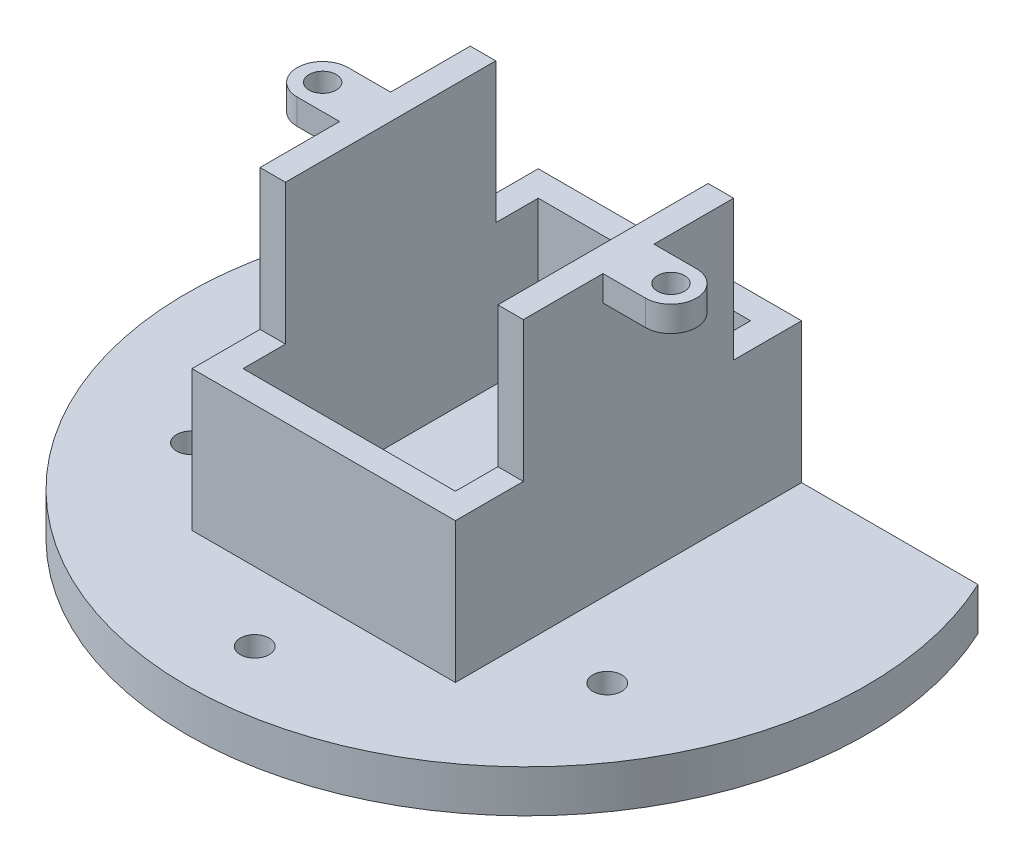
ISO-10303-21;
HEADER;
FILE_DESCRIPTION(('STEP AP214'),'2;1');
FILE_NAME('part.step','',(''),(''),'','','');
FILE_SCHEMA(('AUTOMOTIVE_DESIGN { 1 0 10303 214 1 1 1 1 }'));
ENDSEC;
DATA;
#1=APPLICATION_CONTEXT('core data for automotive mechanical design processes');
#2=APPLICATION_PROTOCOL_DEFINITION('international standard','automotive_design',2000,#1);
#3=PRODUCT_CONTEXT('',#1,'mechanical');
#4=PRODUCT('Part','Part','',(#3));
#5=PRODUCT_RELATED_PRODUCT_CATEGORY('part','',(#4));
#6=PRODUCT_DEFINITION_FORMATION('','',#4);
#7=PRODUCT_DEFINITION_CONTEXT('part definition',#1,'design');
#8=PRODUCT_DEFINITION('design','',#6,#7);
#9=PRODUCT_DEFINITION_SHAPE('','',#8);
#10=(LENGTH_UNIT() NAMED_UNIT(*) SI_UNIT(.MILLI.,.METRE.));
#11=(NAMED_UNIT(*) PLANE_ANGLE_UNIT() SI_UNIT($,.RADIAN.));
#12=(NAMED_UNIT(*) SI_UNIT($,.STERADIAN.) SOLID_ANGLE_UNIT());
#13=UNCERTAINTY_MEASURE_WITH_UNIT(LENGTH_MEASURE(1.E-05),#10,'distance_accuracy_value','');
#14=(GEOMETRIC_REPRESENTATION_CONTEXT(3) GLOBAL_UNCERTAINTY_ASSIGNED_CONTEXT((#13)) GLOBAL_UNIT_ASSIGNED_CONTEXT((#10,
#11,#12)) REPRESENTATION_CONTEXT('',''));
#15=CARTESIAN_POINT('',(0.,0.,0.));
#16=DIRECTION('',(0.,0.,1.));
#17=DIRECTION('',(1.,0.,0.));
#18=AXIS2_PLACEMENT_3D('',#15,#16,#17);
#19=CARTESIAN_POINT('',(0.,38.,-40.75));
#20=DIRECTION('',(0.,1.,0.));
#21=DIRECTION('',(0.,0.,1.));
#22=AXIS2_PLACEMENT_3D('',#19,#20,#21);
#23=PLANE('',#22);
#24=CARTESIAN_POINT('',(-5.,38.,-20.375));
#25=DIRECTION('',(0.,1.,0.));
#26=DIRECTION('',(0.,0.,-1.));
#27=AXIS2_PLACEMENT_3D('',#24,#25,#26);
#28=CIRCLE('',#27,1.6);
#29=CARTESIAN_POINT('',(-5.,38.,-21.975));
#30=VERTEX_POINT('',#29);
#31=EDGE_CURVE('E301',#30,#30,#28,.T.);
#32=ORIENTED_EDGE('',*,*,#31,.F.);
#33=EDGE_LOOP('',(#32));
#34=FACE_BOUND('',#33,.T.);
#35=DIRECTION('',(0.,0.,1.));
#36=VECTOR('',#35,1.);
#37=CARTESIAN_POINT('',(0.,38.,-40.75));
#38=LINE('',#37,#36);
#39=CARTESIAN_POINT('',(0.,38.,-17.375));
#40=VERTEX_POINT('',#39);
#41=CARTESIAN_POINT('',(0.,38.,-8.));
#42=VERTEX_POINT('',#41);
#43=EDGE_CURVE('E425',#40,#42,#38,.T.);
#44=ORIENTED_EDGE('',*,*,#43,.T.);
#45=DIRECTION('',(-1.,0.,0.));
#46=VECTOR('',#45,1.);
#47=CARTESIAN_POINT('',(0.,38.,-8.));
#48=LINE('',#47,#46);
#49=CARTESIAN_POINT('',(3.,38.,-8.));
#50=VERTEX_POINT('',#49);
#51=EDGE_CURVE('E228',#50,#42,#48,.T.);
#52=ORIENTED_EDGE('',*,*,#51,.F.);
#53=DIRECTION('',(0.,0.,1.));
#54=VECTOR('',#53,1.);
#55=CARTESIAN_POINT('',(3.,38.,-3.00000000000003));
#56=LINE('',#55,#54);
#57=CARTESIAN_POINT('',(2.99999999999999,38.,-32.75));
#58=VERTEX_POINT('',#57);
#59=EDGE_CURVE('E374',#58,#50,#56,.T.);
#60=ORIENTED_EDGE('',*,*,#59,.F.);
#61=DIRECTION('',(1.,0.,0.));
#62=VECTOR('',#61,1.);
#63=CARTESIAN_POINT('',(-9.75,38.,-32.75));
#64=LINE('',#63,#62);
#65=CARTESIAN_POINT('',(0.,38.,-32.75));
#66=VERTEX_POINT('',#65);
#67=EDGE_CURVE('E405',#66,#58,#64,.T.);
#68=ORIENTED_EDGE('',*,*,#67,.F.);
#69=CARTESIAN_POINT('',(0.,38.,-23.375));
#70=VERTEX_POINT('',#69);
#71=EDGE_CURVE('E421',#66,#70,#38,.T.);
#72=ORIENTED_EDGE('',*,*,#71,.T.);
#73=DIRECTION('',(-1.,0.,0.));
#74=VECTOR('',#73,1.);
#75=CARTESIAN_POINT('',(-5.,38.,-23.375));
#76=LINE('',#75,#74);
#77=CARTESIAN_POINT('',(-5.,38.,-23.375));
#78=VERTEX_POINT('',#77);
#79=EDGE_CURVE('E305',#70,#78,#76,.T.);
#80=ORIENTED_EDGE('',*,*,#79,.T.);
#81=CARTESIAN_POINT('',(-5.,38.,-20.375));
#82=DIRECTION('',(0.,1.,0.));
#83=DIRECTION('',(0.,0.,-1.));
#84=AXIS2_PLACEMENT_3D('',#81,#82,#83);
#85=CIRCLE('',#84,3.);
#86=CARTESIAN_POINT('',(-5.,38.,-17.375));
#87=VERTEX_POINT('',#86);
#88=EDGE_CURVE('E323',#78,#87,#85,.T.);
#89=ORIENTED_EDGE('',*,*,#88,.T.);
#90=DIRECTION('',(1.,0.,0.));
#91=VECTOR('',#90,1.);
#92=CARTESIAN_POINT('',(0.,38.,-17.375));
#93=LINE('',#92,#91);
#94=EDGE_CURVE('E312',#87,#40,#93,.T.);
#95=ORIENTED_EDGE('',*,*,#94,.T.);
#96=EDGE_LOOP('',(#44,#52,#60,#68,#72,#80,#89,#95));
#97=FACE_BOUND('',#96,.T.);
#98=ADVANCED_FACE('F38',(#34,#97),#23,.T.);
#99=CARTESIAN_POINT('',(36.,38.,-20.375));
#100=DIRECTION('',(0.,1.,0.));
#101=DIRECTION('',(0.,0.,1.));
#102=AXIS2_PLACEMENT_3D('',#99,#100,#101);
#103=CIRCLE('',#102,1.6);
#104=CARTESIAN_POINT('',(36.,38.,-18.775));
#105=VERTEX_POINT('',#104);
#106=EDGE_CURVE('E331',#105,#105,#103,.T.);
#107=ORIENTED_EDGE('',*,*,#106,.F.);
#108=EDGE_LOOP('',(#107));
#109=FACE_BOUND('',#108,.T.);
#110=DIRECTION('',(0.,0.,-1.));
#111=VECTOR('',#110,1.);
#112=CARTESIAN_POINT('',(28.,38.,-3.00000000000003));
#113=LINE('',#112,#111);
#114=CARTESIAN_POINT('',(28.,38.,-8.));
#115=VERTEX_POINT('',#114);
#116=CARTESIAN_POINT('',(28.,38.,-32.75));
#117=VERTEX_POINT('',#116);
#118=EDGE_CURVE('E366',#115,#117,#113,.T.);
#119=ORIENTED_EDGE('',*,*,#118,.F.);
#120=CARTESIAN_POINT('',(31.,38.,-8.));
#121=VERTEX_POINT('',#120);
#122=EDGE_CURVE('E236',#121,#115,#48,.T.);
#123=ORIENTED_EDGE('',*,*,#122,.F.);
#124=DIRECTION('',(0.,0.,1.));
#125=VECTOR('',#124,1.);
#126=CARTESIAN_POINT('',(31.,38.,-40.75));
#127=LINE('',#126,#125);
#128=CARTESIAN_POINT('',(31.,38.,-17.375));
#129=VERTEX_POINT('',#128);
#130=EDGE_CURVE('E417',#129,#121,#127,.T.);
#131=ORIENTED_EDGE('',*,*,#130,.F.);
#132=DIRECTION('',(1.,0.,0.));
#133=VECTOR('',#132,1.);
#134=CARTESIAN_POINT('',(31.,38.,-17.375));
#135=LINE('',#134,#133);
#136=CARTESIAN_POINT('',(36.,38.,-17.375));
#137=VERTEX_POINT('',#136);
#138=EDGE_CURVE('E347',#129,#137,#135,.T.);
#139=ORIENTED_EDGE('',*,*,#138,.T.);
#140=CARTESIAN_POINT('',(36.,38.,-20.375));
#141=DIRECTION('',(0.,1.,0.));
#142=DIRECTION('',(0.,0.,1.));
#143=AXIS2_PLACEMENT_3D('',#140,#141,#142);
#144=CIRCLE('',#143,3.);
#145=CARTESIAN_POINT('',(36.,38.,-23.375));
#146=VERTEX_POINT('',#145);
#147=EDGE_CURVE('E340',#137,#146,#144,.T.);
#148=ORIENTED_EDGE('',*,*,#147,.T.);
#149=DIRECTION('',(-1.,0.,0.));
#150=VECTOR('',#149,1.);
#151=CARTESIAN_POINT('',(36.,38.,-23.375));
#152=LINE('',#151,#150);
#153=CARTESIAN_POINT('',(31.,38.,-23.375));
#154=VERTEX_POINT('',#153);
#155=EDGE_CURVE('E359',#146,#154,#152,.T.);
#156=ORIENTED_EDGE('',*,*,#155,.T.);
#157=CARTESIAN_POINT('',(31.,38.,-32.75));
#158=VERTEX_POINT('',#157);
#159=EDGE_CURVE('E426',#158,#154,#127,.T.);
#160=ORIENTED_EDGE('',*,*,#159,.F.);
#161=EDGE_CURVE('E399',#117,#158,#64,.T.);
#162=ORIENTED_EDGE('',*,*,#161,.F.);
#163=EDGE_LOOP('',(#119,#123,#131,#139,#148,#156,#160,#162));
#164=FACE_BOUND('',#163,.T.);
#165=ADVANCED_FACE('F505',(#109,#164),#23,.T.);
#166=CARTESIAN_POINT('',(0.,0.,-40.75));
#167=DIRECTION('',(-1.,0.,0.));
#168=DIRECTION('',(0.,0.,1.));
#169=AXIS2_PLACEMENT_3D('',#166,#167,#168);
#170=PLANE('',#169);
#171=DIRECTION('',(0.,0.,1.));
#172=VECTOR('',#171,1.);
#173=CARTESIAN_POINT('',(0.,21.5,-8.));
#174=LINE('',#173,#172);
#175=CARTESIAN_POINT('',(0.,21.5,-8.));
#176=VERTEX_POINT('',#175);
#177=CARTESIAN_POINT('',(0.,21.5,0.));
#178=VERTEX_POINT('',#177);
#179=EDGE_CURVE('E216',#176,#178,#174,.T.);
#180=ORIENTED_EDGE('',*,*,#179,.F.);
#181=DIRECTION('',(0.,-1.,0.));
#182=VECTOR('',#181,1.);
#183=CARTESIAN_POINT('',(0.,38.,-8.));
#184=LINE('',#183,#182);
#185=EDGE_CURVE('E225',#42,#176,#184,.T.);
#186=ORIENTED_EDGE('',*,*,#185,.F.);
#187=ORIENTED_EDGE('',*,*,#43,.F.);
#188=DIRECTION('',(0.,1.,0.));
#189=VECTOR('',#188,1.);
#190=CARTESIAN_POINT('',(0.,35.,-17.375));
#191=LINE('',#190,#189);
#192=CARTESIAN_POINT('',(0.,35.,-17.375));
#193=VERTEX_POINT('',#192);
#194=EDGE_CURVE('E332',#193,#40,#191,.T.);
#195=ORIENTED_EDGE('',*,*,#194,.F.);
#196=DIRECTION('',(0.,0.,-1.));
#197=VECTOR('',#196,1.);
#198=CARTESIAN_POINT('',(0.,35.,-23.375));
#199=LINE('',#198,#197);
#200=CARTESIAN_POINT('',(0.,35.,-23.375));
#201=VERTEX_POINT('',#200);
#202=EDGE_CURVE('E317',#193,#201,#199,.T.);
#203=ORIENTED_EDGE('',*,*,#202,.T.);
#204=DIRECTION('',(0.,1.,0.));
#205=VECTOR('',#204,1.);
#206=CARTESIAN_POINT('',(0.,35.,-23.375));
#207=LINE('',#206,#205);
#208=EDGE_CURVE('E328',#201,#70,#207,.T.);
#209=ORIENTED_EDGE('',*,*,#208,.T.);
#210=ORIENTED_EDGE('',*,*,#71,.F.);
#211=DIRECTION('',(0.,1.,0.));
#212=VECTOR('',#211,1.);
#213=CARTESIAN_POINT('',(0.,0.,-32.75));
#214=LINE('',#213,#212);
#215=CARTESIAN_POINT('',(0.,21.5,-32.75));
#216=VERTEX_POINT('',#215);
#217=EDGE_CURVE('E409',#216,#66,#214,.T.);
#218=ORIENTED_EDGE('',*,*,#217,.F.);
#219=DIRECTION('',(0.,0.,1.));
#220=VECTOR('',#219,1.);
#221=CARTESIAN_POINT('',(0.,21.5,-40.75));
#222=LINE('',#221,#220);
#223=CARTESIAN_POINT('',(0.,21.5,-40.75));
#224=VERTEX_POINT('',#223);
#225=EDGE_CURVE('E403',#224,#216,#222,.T.);
#226=ORIENTED_EDGE('',*,*,#225,.F.);
#227=DIRECTION('',(0.,-1.,0.));
#228=VECTOR('',#227,1.);
#229=CARTESIAN_POINT('',(0.,0.,-40.75));
#230=LINE('',#229,#228);
#231=CARTESIAN_POINT('',(0.,5.,-40.75));
#232=VERTEX_POINT('',#231);
#233=EDGE_CURVE('E61',#224,#232,#230,.T.);
#234=ORIENTED_EDGE('',*,*,#233,.T.);
#235=DIRECTION('',(0.,0.,1.));
#236=VECTOR('',#235,1.);
#237=CARTESIAN_POINT('',(0.,5.,-40.75));
#238=LINE('',#237,#236);
#239=CARTESIAN_POINT('',(0.,5.,0.));
#240=VERTEX_POINT('',#239);
#241=EDGE_CURVE('E299',#232,#240,#238,.T.);
#242=ORIENTED_EDGE('',*,*,#241,.T.);
#243=DIRECTION('',(0.,-1.,0.));
#244=VECTOR('',#243,1.);
#245=CARTESIAN_POINT('',(0.,0.,0.));
#246=LINE('',#245,#244);
#247=EDGE_CURVE('E234',#178,#240,#246,.T.);
#248=ORIENTED_EDGE('',*,*,#247,.F.);
#249=EDGE_LOOP('',(#180,#186,#187,#195,#203,#209,#210,#218,#226,#234,#242,#248));
#250=FACE_BOUND('',#249,.T.);
#251=ADVANCED_FACE('F40',(#250),#170,.T.);
#252=CARTESIAN_POINT('',(31.,0.,-40.75));
#253=DIRECTION('',(1.,0.,0.));
#254=DIRECTION('',(0.,0.,-1.));
#255=AXIS2_PLACEMENT_3D('',#252,#253,#254);
#256=PLANE('',#255);
#257=DIRECTION('',(0.,0.,1.));
#258=VECTOR('',#257,1.);
#259=CARTESIAN_POINT('',(31.,21.5,-8.));
#260=LINE('',#259,#258);
#261=CARTESIAN_POINT('',(31.,21.5,-8.));
#262=VERTEX_POINT('',#261);
#263=CARTESIAN_POINT('',(31.,21.5,0.));
#264=VERTEX_POINT('',#263);
#265=EDGE_CURVE('E235',#262,#264,#260,.T.);
#266=ORIENTED_EDGE('',*,*,#265,.T.);
#267=DIRECTION('',(0.,1.,0.));
#268=VECTOR('',#267,1.);
#269=CARTESIAN_POINT('',(31.,0.,0.));
#270=LINE('',#269,#268);
#271=CARTESIAN_POINT('',(31.,5.,0.));
#272=VERTEX_POINT('',#271);
#273=EDGE_CURVE('E413',#272,#264,#270,.T.);
#274=ORIENTED_EDGE('',*,*,#273,.F.);
#275=DIRECTION('',(0.,0.,-1.));
#276=VECTOR('',#275,1.);
#277=CARTESIAN_POINT('',(31.,5.,-40.75));
#278=LINE('',#277,#276);
#279=CARTESIAN_POINT('',(31.,5.,-40.75));
#280=VERTEX_POINT('',#279);
#281=EDGE_CURVE('E297',#272,#280,#278,.T.);
#282=ORIENTED_EDGE('',*,*,#281,.T.);
#283=DIRECTION('',(0.,1.,0.));
#284=VECTOR('',#283,1.);
#285=CARTESIAN_POINT('',(31.,0.,-40.75));
#286=LINE('',#285,#284);
#287=CARTESIAN_POINT('',(31.,21.5,-40.75));
#288=VERTEX_POINT('',#287);
#289=EDGE_CURVE('E415',#280,#288,#286,.T.);
#290=ORIENTED_EDGE('',*,*,#289,.T.);
#291=DIRECTION('',(0.,0.,-1.));
#292=VECTOR('',#291,1.);
#293=CARTESIAN_POINT('',(31.,21.5,-40.75));
#294=LINE('',#293,#292);
#295=CARTESIAN_POINT('',(31.,21.5,-32.75));
#296=VERTEX_POINT('',#295);
#297=EDGE_CURVE('E396',#296,#288,#294,.T.);
#298=ORIENTED_EDGE('',*,*,#297,.F.);
#299=DIRECTION('',(0.,-1.,0.));
#300=VECTOR('',#299,1.);
#301=CARTESIAN_POINT('',(31.,38.,-32.75));
#302=LINE('',#301,#300);
#303=EDGE_CURVE('E393',#158,#296,#302,.T.);
#304=ORIENTED_EDGE('',*,*,#303,.F.);
#305=ORIENTED_EDGE('',*,*,#159,.T.);
#306=DIRECTION('',(0.,1.,0.));
#307=VECTOR('',#306,1.);
#308=CARTESIAN_POINT('',(31.,35.,-23.375));
#309=LINE('',#308,#307);
#310=CARTESIAN_POINT('',(31.,35.,-23.375));
#311=VERTEX_POINT('',#310);
#312=EDGE_CURVE('E370',#311,#154,#309,.T.);
#313=ORIENTED_EDGE('',*,*,#312,.F.);
#314=DIRECTION('',(0.,0.,1.));
#315=VECTOR('',#314,1.);
#316=CARTESIAN_POINT('',(31.,35.,-23.375));
#317=LINE('',#316,#315);
#318=CARTESIAN_POINT('',(31.,35.,-17.375));
#319=VERTEX_POINT('',#318);
#320=EDGE_CURVE('E350',#311,#319,#317,.T.);
#321=ORIENTED_EDGE('',*,*,#320,.T.);
#322=DIRECTION('',(0.,1.,0.));
#323=VECTOR('',#322,1.);
#324=CARTESIAN_POINT('',(31.,35.,-17.375));
#325=LINE('',#324,#323);
#326=EDGE_CURVE('E367',#319,#129,#325,.T.);
#327=ORIENTED_EDGE('',*,*,#326,.T.);
#328=ORIENTED_EDGE('',*,*,#130,.T.);
#329=DIRECTION('',(0.,1.,0.));
#330=VECTOR('',#329,1.);
#331=CARTESIAN_POINT('',(31.,38.,-8.));
#332=LINE('',#331,#330);
#333=EDGE_CURVE('E53',#262,#121,#332,.T.);
#334=ORIENTED_EDGE('',*,*,#333,.F.);
#335=EDGE_LOOP('',(#266,#274,#282,#290,#298,#304,#305,#313,#321,#327,#328,#334));
#336=FACE_BOUND('',#335,.T.);
#337=ADVANCED_FACE('F457',(#336),#256,.T.);
#338=CARTESIAN_POINT('',(0.,0.,0.));
#339=DIRECTION('',(0.,0.,-1.));
#340=DIRECTION('',(-1.,0.,0.));
#341=AXIS2_PLACEMENT_3D('',#338,#339,#340);
#342=PLANE('',#341);
#343=ORIENTED_EDGE('',*,*,#273,.T.);
#344=DIRECTION('',(1.,0.,0.));
#345=VECTOR('',#344,1.);
#346=CARTESIAN_POINT('',(0.,21.5,0.));
#347=LINE('',#346,#345);
#348=EDGE_CURVE('E231',#178,#264,#347,.T.);
#349=ORIENTED_EDGE('',*,*,#348,.F.);
#350=ORIENTED_EDGE('',*,*,#247,.T.);
#351=DIRECTION('',(-1.,0.,0.));
#352=VECTOR('',#351,1.);
#353=CARTESIAN_POINT('',(0.,5.,0.));
#354=LINE('',#353,#352);
#355=EDGE_CURVE('E294',#272,#240,#354,.T.);
#356=ORIENTED_EDGE('',*,*,#355,.F.);
#357=EDGE_LOOP('',(#343,#349,#350,#356));
#358=FACE_BOUND('',#357,.T.);
#359=ADVANCED_FACE('F460',(#358),#342,.F.);
#360=CARTESIAN_POINT('',(2.99999999999999,3.5,-37.75));
#361=DIRECTION('',(0.,0.,-1.));
#362=DIRECTION('',(-1.,0.,0.));
#363=AXIS2_PLACEMENT_3D('',#360,#361,#362);
#364=PLANE('',#363);
#365=DIRECTION('',(-1.,0.,0.));
#366=VECTOR('',#365,1.);
#367=CARTESIAN_POINT('',(2.99999999999999,5.,-37.75));
#368=LINE('',#367,#366);
#369=CARTESIAN_POINT('',(28.,5.,-37.75));
#370=VERTEX_POINT('',#369);
#371=CARTESIAN_POINT('',(2.99999999999999,5.,-37.75));
#372=VERTEX_POINT('',#371);
#373=EDGE_CURVE('E291',#370,#372,#368,.T.);
#374=ORIENTED_EDGE('',*,*,#373,.F.);
#375=DIRECTION('',(0.,1.,0.));
#376=VECTOR('',#375,1.);
#377=CARTESIAN_POINT('',(28.,3.5,-37.75));
#378=LINE('',#377,#376);
#379=CARTESIAN_POINT('',(28.,21.5,-37.75));
#380=VERTEX_POINT('',#379);
#381=EDGE_CURVE('E377',#370,#380,#378,.T.);
#382=ORIENTED_EDGE('',*,*,#381,.T.);
#383=DIRECTION('',(1.,0.,0.));
#384=VECTOR('',#383,1.);
#385=CARTESIAN_POINT('',(-9.75,21.5,-37.75));
#386=LINE('',#385,#384);
#387=CARTESIAN_POINT('',(2.99999999999999,21.5,-37.75));
#388=VERTEX_POINT('',#387);
#389=EDGE_CURVE('E436',#388,#380,#386,.T.);
#390=ORIENTED_EDGE('',*,*,#389,.F.);
#391=DIRECTION('',(0.,1.,0.));
#392=VECTOR('',#391,1.);
#393=CARTESIAN_POINT('',(2.99999999999999,3.5,-37.75));
#394=LINE('',#393,#392);
#395=EDGE_CURVE('E385',#372,#388,#394,.T.);
#396=ORIENTED_EDGE('',*,*,#395,.F.);
#397=EDGE_LOOP('',(#374,#382,#390,#396));
#398=FACE_BOUND('',#397,.T.);
#399=ADVANCED_FACE('F659',(#398),#364,.F.);
#400=CARTESIAN_POINT('',(28.,3.5,-3.00000000000003));
#401=DIRECTION('',(1.,0.,0.));
#402=DIRECTION('',(0.,0.,-1.));
#403=AXIS2_PLACEMENT_3D('',#400,#401,#402);
#404=PLANE('',#403);
#405=DIRECTION('',(0.,1.,0.));
#406=VECTOR('',#405,1.);
#407=CARTESIAN_POINT('',(28.,3.5,-3.00000000000003));
#408=LINE('',#407,#406);
#409=CARTESIAN_POINT('',(28.,5.,-3.00000000000003));
#410=VERTEX_POINT('',#409);
#411=CARTESIAN_POINT('',(28.,21.5,-3.00000000000003));
#412=VERTEX_POINT('',#411);
#413=EDGE_CURVE('E378',#410,#412,#408,.T.);
#414=ORIENTED_EDGE('',*,*,#413,.T.);
#415=DIRECTION('',(0.,0.,-1.));
#416=VECTOR('',#415,1.);
#417=CARTESIAN_POINT('',(28.,21.5,-3.00000000000003));
#418=LINE('',#417,#416);
#419=CARTESIAN_POINT('',(28.,21.5,-8.));
#420=VERTEX_POINT('',#419);
#421=EDGE_CURVE('E248',#412,#420,#418,.T.);
#422=ORIENTED_EDGE('',*,*,#421,.T.);
#423=DIRECTION('',(0.,-1.,0.));
#424=VECTOR('',#423,1.);
#425=CARTESIAN_POINT('',(28.,3.5,-8.));
#426=LINE('',#425,#424);
#427=EDGE_CURVE('E245',#115,#420,#426,.T.);
#428=ORIENTED_EDGE('',*,*,#427,.F.);
#429=ORIENTED_EDGE('',*,*,#118,.T.);
#430=DIRECTION('',(0.,1.,0.));
#431=VECTOR('',#430,1.);
#432=CARTESIAN_POINT('',(28.,38.,-32.75));
#433=LINE('',#432,#431);
#434=CARTESIAN_POINT('',(28.,21.5,-32.75));
#435=VERTEX_POINT('',#434);
#436=EDGE_CURVE('E433',#435,#117,#433,.T.);
#437=ORIENTED_EDGE('',*,*,#436,.F.);
#438=DIRECTION('',(0.,0.,1.));
#439=VECTOR('',#438,1.);
#440=CARTESIAN_POINT('',(28.,21.5,-40.75));
#441=LINE('',#440,#439);
#442=EDGE_CURVE('E390',#380,#435,#441,.T.);
#443=ORIENTED_EDGE('',*,*,#442,.F.);
#444=ORIENTED_EDGE('',*,*,#381,.F.);
#445=DIRECTION('',(0.,0.,-1.));
#446=VECTOR('',#445,1.);
#447=CARTESIAN_POINT('',(28.,5.,-3.00000000000003));
#448=LINE('',#447,#446);
#449=EDGE_CURVE('E288',#410,#370,#448,.T.);
#450=ORIENTED_EDGE('',*,*,#449,.F.);
#451=EDGE_LOOP('',(#414,#422,#428,#429,#437,#443,#444,#450));
#452=FACE_BOUND('',#451,.T.);
#453=ADVANCED_FACE('F663',(#452),#404,.F.);
#454=CARTESIAN_POINT('',(3.,3.5,-3.00000000000003));
#455=DIRECTION('',(-1.,0.,0.));
#456=DIRECTION('',(0.,0.,1.));
#457=AXIS2_PLACEMENT_3D('',#454,#455,#456);
#458=PLANE('',#457);
#459=DIRECTION('',(0.,1.,0.));
#460=VECTOR('',#459,1.);
#461=CARTESIAN_POINT('',(3.,3.5,-8.));
#462=LINE('',#461,#460);
#463=CARTESIAN_POINT('',(3.,21.5,-8.));
#464=VERTEX_POINT('',#463);
#465=EDGE_CURVE('E239',#464,#50,#462,.T.);
#466=ORIENTED_EDGE('',*,*,#465,.F.);
#467=DIRECTION('',(0.,0.,1.));
#468=VECTOR('',#467,1.);
#469=CARTESIAN_POINT('',(3.,21.5,-3.00000000000003));
#470=LINE('',#469,#468);
#471=CARTESIAN_POINT('',(3.,21.5,-3.00000000000003));
#472=VERTEX_POINT('',#471);
#473=EDGE_CURVE('E219',#464,#472,#470,.T.);
#474=ORIENTED_EDGE('',*,*,#473,.T.);
#475=DIRECTION('',(0.,1.,0.));
#476=VECTOR('',#475,1.);
#477=CARTESIAN_POINT('',(3.,3.5,-3.00000000000003));
#478=LINE('',#477,#476);
#479=CARTESIAN_POINT('',(3.,5.,-3.00000000000003));
#480=VERTEX_POINT('',#479);
#481=EDGE_CURVE('E382',#480,#472,#478,.T.);
#482=ORIENTED_EDGE('',*,*,#481,.F.);
#483=DIRECTION('',(0.,0.,1.));
#484=VECTOR('',#483,1.);
#485=CARTESIAN_POINT('',(3.,5.,-3.00000000000003));
#486=LINE('',#485,#484);
#487=EDGE_CURVE('E283',#372,#480,#486,.T.);
#488=ORIENTED_EDGE('',*,*,#487,.F.);
#489=ORIENTED_EDGE('',*,*,#395,.T.);
#490=DIRECTION('',(0.,0.,-1.));
#491=VECTOR('',#490,1.);
#492=CARTESIAN_POINT('',(2.99999999999999,21.5,-40.75));
#493=LINE('',#492,#491);
#494=CARTESIAN_POINT('',(2.99999999999999,21.5,-32.75));
#495=VERTEX_POINT('',#494);
#496=EDGE_CURVE('E381',#495,#388,#493,.T.);
#497=ORIENTED_EDGE('',*,*,#496,.F.);
#498=DIRECTION('',(0.,-1.,0.));
#499=VECTOR('',#498,1.);
#500=CARTESIAN_POINT('',(2.99999999999999,38.,-32.75));
#501=LINE('',#500,#499);
#502=EDGE_CURVE('E430',#58,#495,#501,.T.);
#503=ORIENTED_EDGE('',*,*,#502,.F.);
#504=ORIENTED_EDGE('',*,*,#59,.T.);
#505=EDGE_LOOP('',(#466,#474,#482,#488,#489,#497,#503,#504));
#506=FACE_BOUND('',#505,.T.);
#507=ADVANCED_FACE('F446',(#506),#458,.F.);
#508=CARTESIAN_POINT('',(3.,3.5,-3.00000000000003));
#509=DIRECTION('',(0.,0.,1.));
#510=DIRECTION('',(1.,0.,0.));
#511=AXIS2_PLACEMENT_3D('',#508,#509,#510);
#512=PLANE('',#511);
#513=ORIENTED_EDGE('',*,*,#481,.T.);
#514=DIRECTION('',(1.,0.,0.));
#515=VECTOR('',#514,1.);
#516=CARTESIAN_POINT('',(3.,21.5,-3.00000000000003));
#517=LINE('',#516,#515);
#518=EDGE_CURVE('E11',#472,#412,#517,.T.);
#519=ORIENTED_EDGE('',*,*,#518,.T.);
#520=ORIENTED_EDGE('',*,*,#413,.F.);
#521=DIRECTION('',(1.,0.,0.));
#522=VECTOR('',#521,1.);
#523=CARTESIAN_POINT('',(3.,5.,-3.00000000000003));
#524=LINE('',#523,#522);
#525=EDGE_CURVE('E46',#480,#410,#524,.T.);
#526=ORIENTED_EDGE('',*,*,#525,.F.);
#527=EDGE_LOOP('',(#513,#519,#520,#526));
#528=FACE_BOUND('',#527,.T.);
#529=ADVANCED_FACE('F444',(#528),#512,.F.);
#530=CARTESIAN_POINT('',(-9.75,38.,-32.75));
#531=DIRECTION('',(0.,0.,1.));
#532=DIRECTION('',(0.,-1.,0.));
#533=AXIS2_PLACEMENT_3D('',#530,#531,#532);
#534=PLANE('',#533);
#535=DIRECTION('',(1.,0.,0.));
#536=VECTOR('',#535,1.);
#537=CARTESIAN_POINT('',(-9.75,21.5,-32.75));
#538=LINE('',#537,#536);
#539=EDGE_CURVE('E404',#435,#296,#538,.T.);
#540=ORIENTED_EDGE('',*,*,#539,.F.);
#541=ORIENTED_EDGE('',*,*,#436,.T.);
#542=ORIENTED_EDGE('',*,*,#161,.T.);
#543=ORIENTED_EDGE('',*,*,#303,.T.);
#544=EDGE_LOOP('',(#540,#541,#542,#543));
#545=FACE_BOUND('',#544,.T.);
#546=ADVANCED_FACE('F520',(#545),#534,.F.);
#547=CARTESIAN_POINT('',(0.,0.,-40.75));
#548=DIRECTION('',(0.,-1.,0.));
#549=DIRECTION('',(0.,0.,-1.));
#550=AXIS2_PLACEMENT_3D('',#547,#548,#549);
#551=PLANE('',#550);
#552=CARTESIAN_POINT('',(15.5,0.,8.125));
#553=DIRECTION('',(0.,-1.,0.));
#554=DIRECTION('',(0.,0.,-1.));
#555=AXIS2_PLACEMENT_3D('',#552,#553,#554);
#556=CIRCLE('',#555,1.7);
#557=CARTESIAN_POINT('',(15.5,0.,6.425));
#558=VERTEX_POINT('',#557);
#559=EDGE_CURVE('E254',#558,#558,#556,.T.);
#560=ORIENTED_EDGE('',*,*,#559,.F.);
#561=EDGE_LOOP('',(#560));
#562=FACE_BOUND('',#561,.T.);
#563=CARTESIAN_POINT('',(40.,0.,-8.87500000000005));
#564=DIRECTION('',(0.,-1.,0.));
#565=DIRECTION('',(0.,0.,-1.));
#566=AXIS2_PLACEMENT_3D('',#563,#564,#565);
#567=CIRCLE('',#566,1.7);
#568=CARTESIAN_POINT('',(40.,0.,-10.575));
#569=VERTEX_POINT('',#568);
#570=EDGE_CURVE('E266',#569,#569,#567,.T.);
#571=ORIENTED_EDGE('',*,*,#570,.F.);
#572=EDGE_LOOP('',(#571));
#573=FACE_BOUND('',#572,.T.);
#574=CARTESIAN_POINT('',(-9.,0.,-8.87500000000005));
#575=DIRECTION('',(0.,-1.,0.));
#576=DIRECTION('',(0.,0.,-1.));
#577=AXIS2_PLACEMENT_3D('',#574,#575,#576);
#578=CIRCLE('',#577,1.7);
#579=CARTESIAN_POINT('',(-9.,0.,-10.575));
#580=VERTEX_POINT('',#579);
#581=EDGE_CURVE('E261',#580,#580,#578,.T.);
#582=ORIENTED_EDGE('',*,*,#581,.F.);
#583=EDGE_LOOP('',(#582));
#584=FACE_BOUND('',#583,.T.);
#585=DIRECTION('',(1.,0.,0.));
#586=VECTOR('',#585,1.);
#587=CARTESIAN_POINT('',(0.,0.,-40.75));
#588=LINE('',#587,#586);
#589=CARTESIAN_POINT('',(-20.76616019101,0.,-40.75));
#590=VERTEX_POINT('',#589);
#591=CARTESIAN_POINT('',(51.76616019101,0.,-40.75));
#592=VERTEX_POINT('',#591);
#593=EDGE_CURVE('E412',#590,#592,#588,.T.);
#594=ORIENTED_EDGE('',*,*,#593,.T.);
#595=CARTESIAN_POINT('',(15.5,0.,-23.875));
#596=DIRECTION('',(0.,-1.,0.));
#597=DIRECTION('',(0.,0.,-1.));
#598=AXIS2_PLACEMENT_3D('',#595,#596,#597);
#599=CIRCLE('',#598,40.);
#600=EDGE_CURVE('E269',#592,#590,#599,.T.);
#601=ORIENTED_EDGE('',*,*,#600,.T.);
#602=EDGE_LOOP('',(#594,#601));
#603=FACE_BOUND('',#602,.T.);
#604=ADVANCED_FACE('F518',(#562,#573,#584,#603),#551,.T.);
#605=CARTESIAN_POINT('',(0.,0.,-40.75));
#606=DIRECTION('',(0.,0.,-1.));
#607=DIRECTION('',(-1.,0.,0.));
#608=AXIS2_PLACEMENT_3D('',#605,#606,#607);
#609=PLANE('',#608);
#610=ORIENTED_EDGE('',*,*,#593,.F.);
#611=DIRECTION('',(0.,-1.,0.));
#612=VECTOR('',#611,1.);
#613=CARTESIAN_POINT('',(-20.76616019101,5.,-40.75));
#614=LINE('',#613,#612);
#615=CARTESIAN_POINT('',(-20.76616019101,5.,-40.75));
#616=VERTEX_POINT('',#615);
#617=EDGE_CURVE('E277',#616,#590,#614,.T.);
#618=ORIENTED_EDGE('',*,*,#617,.F.);
#619=DIRECTION('',(1.,0.,0.));
#620=VECTOR('',#619,1.);
#621=CARTESIAN_POINT('',(-20.76616019101,5.,-40.75));
#622=LINE('',#621,#620);
#623=EDGE_CURVE('E274',#616,#232,#622,.T.);
#624=ORIENTED_EDGE('',*,*,#623,.T.);
#625=ORIENTED_EDGE('',*,*,#233,.F.);
#626=DIRECTION('',(-1.,0.,0.));
#627=VECTOR('',#626,1.);
#628=CARTESIAN_POINT('',(0.,21.5,-40.75));
#629=LINE('',#628,#627);
#630=EDGE_CURVE('E424',#288,#224,#629,.T.);
#631=ORIENTED_EDGE('',*,*,#630,.F.);
#632=ORIENTED_EDGE('',*,*,#289,.F.);
#633=CARTESIAN_POINT('',(51.76616019101,5.,-40.75));
#634=VERTEX_POINT('',#633);
#635=EDGE_CURVE('E273',#280,#634,#622,.T.);
#636=ORIENTED_EDGE('',*,*,#635,.T.);
#637=DIRECTION('',(0.,-1.,0.));
#638=VECTOR('',#637,1.);
#639=CARTESIAN_POINT('',(51.76616019101,5.,-40.75));
#640=LINE('',#639,#638);
#641=EDGE_CURVE('E280',#634,#592,#640,.T.);
#642=ORIENTED_EDGE('',*,*,#641,.T.);
#643=EDGE_LOOP('',(#610,#618,#624,#625,#631,#632,#636,#642));
#644=FACE_BOUND('',#643,.T.);
#645=ADVANCED_FACE('F470',(#644),#609,.T.);
#646=CARTESIAN_POINT('',(-9.75,21.5,-40.75));
#647=DIRECTION('',(0.,-1.,0.));
#648=DIRECTION('',(0.,0.,-1.));
#649=AXIS2_PLACEMENT_3D('',#646,#647,#648);
#650=PLANE('',#649);
#651=ORIENTED_EDGE('',*,*,#389,.T.);
#652=ORIENTED_EDGE('',*,*,#442,.T.);
#653=ORIENTED_EDGE('',*,*,#539,.T.);
#654=ORIENTED_EDGE('',*,*,#297,.T.);
#655=ORIENTED_EDGE('',*,*,#630,.T.);
#656=ORIENTED_EDGE('',*,*,#225,.T.);
#657=EDGE_CURVE('E400',#216,#495,#538,.T.);
#658=ORIENTED_EDGE('',*,*,#657,.T.);
#659=ORIENTED_EDGE('',*,*,#496,.T.);
#660=EDGE_LOOP('',(#651,#652,#653,#654,#655,#656,#658,#659));
#661=FACE_BOUND('',#660,.T.);
#662=ADVANCED_FACE('F473',(#661),#650,.F.);
#663=ORIENTED_EDGE('',*,*,#67,.T.);
#664=ORIENTED_EDGE('',*,*,#502,.T.);
#665=ORIENTED_EDGE('',*,*,#657,.F.);
#666=ORIENTED_EDGE('',*,*,#217,.T.);
#667=EDGE_LOOP('',(#663,#664,#665,#666));
#668=FACE_BOUND('',#667,.T.);
#669=ADVANCED_FACE('F478',(#668),#534,.F.);
#670=CARTESIAN_POINT('',(36.,35.,-20.375));
#671=DIRECTION('',(0.,1.,0.));
#672=DIRECTION('',(0.,0.,1.));
#673=AXIS2_PLACEMENT_3D('',#670,#671,#672);
#674=CYLINDRICAL_SURFACE('',#673,3.);
#675=ORIENTED_EDGE('',*,*,#147,.F.);
#676=DIRECTION('',(0.,1.,0.));
#677=VECTOR('',#676,1.);
#678=CARTESIAN_POINT('',(36.,35.,-17.375));
#679=LINE('',#678,#677);
#680=CARTESIAN_POINT('',(36.,35.,-17.375));
#681=VERTEX_POINT('',#680);
#682=EDGE_CURVE('E364',#681,#137,#679,.T.);
#683=ORIENTED_EDGE('',*,*,#682,.F.);
#684=CARTESIAN_POINT('',(36.,35.,-20.375));
#685=DIRECTION('',(0.,1.,0.));
#686=DIRECTION('',(0.,0.,1.));
#687=AXIS2_PLACEMENT_3D('',#684,#685,#686);
#688=CIRCLE('',#687,3.);
#689=CARTESIAN_POINT('',(36.,35.,-23.375));
#690=VERTEX_POINT('',#689);
#691=EDGE_CURVE('E343',#681,#690,#688,.T.);
#692=ORIENTED_EDGE('',*,*,#691,.T.);
#693=DIRECTION('',(0.,1.,0.));
#694=VECTOR('',#693,1.);
#695=CARTESIAN_POINT('',(36.,35.,-23.375));
#696=LINE('',#695,#694);
#697=EDGE_CURVE('E356',#690,#146,#696,.T.);
#698=ORIENTED_EDGE('',*,*,#697,.T.);
#699=EDGE_LOOP('',(#675,#683,#692,#698));
#700=FACE_BOUND('',#699,.T.);
#701=ADVANCED_FACE('F703',(#700),#674,.T.);
#702=CARTESIAN_POINT('',(31.,35.,-17.375));
#703=DIRECTION('',(0.,0.,1.));
#704=DIRECTION('',(1.,0.,0.));
#705=AXIS2_PLACEMENT_3D('',#702,#703,#704);
#706=PLANE('',#705);
#707=ORIENTED_EDGE('',*,*,#138,.F.);
#708=ORIENTED_EDGE('',*,*,#326,.F.);
#709=DIRECTION('',(1.,0.,0.));
#710=VECTOR('',#709,1.);
#711=CARTESIAN_POINT('',(31.,35.,-17.375));
#712=LINE('',#711,#710);
#713=EDGE_CURVE('E353',#319,#681,#712,.T.);
#714=ORIENTED_EDGE('',*,*,#713,.T.);
#715=ORIENTED_EDGE('',*,*,#682,.T.);
#716=EDGE_LOOP('',(#707,#708,#714,#715));
#717=FACE_BOUND('',#716,.T.);
#718=ADVANCED_FACE('F709',(#717),#706,.T.);
#719=CARTESIAN_POINT('',(36.,35.,-23.375));
#720=DIRECTION('',(0.,0.,-1.));
#721=DIRECTION('',(-1.,0.,0.));
#722=AXIS2_PLACEMENT_3D('',#719,#720,#721);
#723=PLANE('',#722);
#724=ORIENTED_EDGE('',*,*,#155,.F.);
#725=ORIENTED_EDGE('',*,*,#697,.F.);
#726=DIRECTION('',(-1.,0.,0.));
#727=VECTOR('',#726,1.);
#728=CARTESIAN_POINT('',(36.,35.,-23.375));
#729=LINE('',#728,#727);
#730=EDGE_CURVE('E346',#690,#311,#729,.T.);
#731=ORIENTED_EDGE('',*,*,#730,.T.);
#732=ORIENTED_EDGE('',*,*,#312,.T.);
#733=EDGE_LOOP('',(#724,#725,#731,#732));
#734=FACE_BOUND('',#733,.T.);
#735=ADVANCED_FACE('F717',(#734),#723,.T.);
#736=CARTESIAN_POINT('',(36.,35.,-20.375));
#737=DIRECTION('',(0.,1.,0.));
#738=DIRECTION('',(0.,0.,1.));
#739=AXIS2_PLACEMENT_3D('',#736,#737,#738);
#740=PLANE('',#739);
#741=CARTESIAN_POINT('',(36.,35.,-20.375));
#742=DIRECTION('',(0.,1.,0.));
#743=DIRECTION('',(0.,0.,1.));
#744=AXIS2_PLACEMENT_3D('',#741,#742,#743);
#745=CIRCLE('',#744,1.6);
#746=CARTESIAN_POINT('',(36.,35.,-18.775));
#747=VERTEX_POINT('',#746);
#748=EDGE_CURVE('E337',#747,#747,#745,.T.);
#749=ORIENTED_EDGE('',*,*,#748,.T.);
#750=EDGE_LOOP('',(#749));
#751=FACE_BOUND('',#750,.T.);
#752=ORIENTED_EDGE('',*,*,#691,.F.);
#753=ORIENTED_EDGE('',*,*,#713,.F.);
#754=ORIENTED_EDGE('',*,*,#320,.F.);
#755=ORIENTED_EDGE('',*,*,#730,.F.);
#756=EDGE_LOOP('',(#752,#753,#754,#755));
#757=FACE_BOUND('',#756,.T.);
#758=ADVANCED_FACE('F725',(#751,#757),#740,.F.);
#759=CARTESIAN_POINT('',(36.,35.,-20.375));
#760=DIRECTION('',(0.,1.,0.));
#761=DIRECTION('',(0.,0.,1.));
#762=AXIS2_PLACEMENT_3D('',#759,#760,#761);
#763=CYLINDRICAL_SURFACE('',#762,1.6);
#764=ORIENTED_EDGE('',*,*,#748,.F.);
#765=EDGE_LOOP('',(#764));
#766=FACE_BOUND('',#765,.T.);
#767=ORIENTED_EDGE('',*,*,#106,.T.);
#768=EDGE_LOOP('',(#767));
#769=FACE_BOUND('',#768,.T.);
#770=ADVANCED_FACE('F501',(#766,#769),#763,.F.);
#771=CARTESIAN_POINT('',(-5.,35.,-23.375));
#772=DIRECTION('',(0.,0.,-1.));
#773=DIRECTION('',(-1.,0.,0.));
#774=AXIS2_PLACEMENT_3D('',#771,#772,#773);
#775=PLANE('',#774);
#776=ORIENTED_EDGE('',*,*,#79,.F.);
#777=ORIENTED_EDGE('',*,*,#208,.F.);
#778=DIRECTION('',(-1.,0.,0.));
#779=VECTOR('',#778,1.);
#780=CARTESIAN_POINT('',(-5.,35.,-23.375));
#781=LINE('',#780,#779);
#782=CARTESIAN_POINT('',(-5.,35.,-23.375));
#783=VERTEX_POINT('',#782);
#784=EDGE_CURVE('E308',#201,#783,#781,.T.);
#785=ORIENTED_EDGE('',*,*,#784,.T.);
#786=DIRECTION('',(0.,1.,0.));
#787=VECTOR('',#786,1.);
#788=CARTESIAN_POINT('',(-5.,35.,-23.375));
#789=LINE('',#788,#787);
#790=EDGE_CURVE('E320',#783,#78,#789,.T.);
#791=ORIENTED_EDGE('',*,*,#790,.T.);
#792=EDGE_LOOP('',(#776,#777,#785,#791));
#793=FACE_BOUND('',#792,.T.);
#794=ADVANCED_FACE('F481',(#793),#775,.T.);
#795=CARTESIAN_POINT('',(0.,35.,-17.375));
#796=DIRECTION('',(0.,0.,1.));
#797=DIRECTION('',(1.,0.,0.));
#798=AXIS2_PLACEMENT_3D('',#795,#796,#797);
#799=PLANE('',#798);
#800=ORIENTED_EDGE('',*,*,#94,.F.);
#801=DIRECTION('',(0.,1.,0.));
#802=VECTOR('',#801,1.);
#803=CARTESIAN_POINT('',(-5.,35.,-17.375));
#804=LINE('',#803,#802);
#805=CARTESIAN_POINT('',(-5.,35.,-17.375));
#806=VERTEX_POINT('',#805);
#807=EDGE_CURVE('E334',#806,#87,#804,.T.);
#808=ORIENTED_EDGE('',*,*,#807,.F.);
#809=DIRECTION('',(1.,0.,0.));
#810=VECTOR('',#809,1.);
#811=CARTESIAN_POINT('',(0.,35.,-17.375));
#812=LINE('',#811,#810);
#813=EDGE_CURVE('E315',#806,#193,#812,.T.);
#814=ORIENTED_EDGE('',*,*,#813,.T.);
#815=ORIENTED_EDGE('',*,*,#194,.T.);
#816=EDGE_LOOP('',(#800,#808,#814,#815));
#817=FACE_BOUND('',#816,.T.);
#818=ADVANCED_FACE('F493',(#817),#799,.T.);
#819=CARTESIAN_POINT('',(-5.,35.,-20.375));
#820=DIRECTION('',(0.,1.,0.));
#821=DIRECTION('',(0.,0.,1.));
#822=AXIS2_PLACEMENT_3D('',#819,#820,#821);
#823=CYLINDRICAL_SURFACE('',#822,3.);
#824=ORIENTED_EDGE('',*,*,#88,.F.);
#825=ORIENTED_EDGE('',*,*,#790,.F.);
#826=CARTESIAN_POINT('',(-5.,35.,-20.375));
#827=DIRECTION('',(0.,1.,0.));
#828=DIRECTION('',(0.,0.,-1.));
#829=AXIS2_PLACEMENT_3D('',#826,#827,#828);
#830=CIRCLE('',#829,3.);
#831=EDGE_CURVE('E311',#783,#806,#830,.T.);
#832=ORIENTED_EDGE('',*,*,#831,.T.);
#833=ORIENTED_EDGE('',*,*,#807,.T.);
#834=EDGE_LOOP('',(#824,#825,#832,#833));
#835=FACE_BOUND('',#834,.T.);
#836=ADVANCED_FACE('F490',(#835),#823,.T.);
#837=CARTESIAN_POINT('',(-5.,35.,-20.375));
#838=DIRECTION('',(0.,-1.,0.));
#839=DIRECTION('',(0.,0.,-1.));
#840=AXIS2_PLACEMENT_3D('',#837,#838,#839);
#841=PLANE('',#840);
#842=CARTESIAN_POINT('',(-5.,35.,-20.375));
#843=DIRECTION('',(0.,1.,0.));
#844=DIRECTION('',(0.,0.,-1.));
#845=AXIS2_PLACEMENT_3D('',#842,#843,#844);
#846=CIRCLE('',#845,1.6);
#847=CARTESIAN_POINT('',(-5.,35.,-21.975));
#848=VERTEX_POINT('',#847);
#849=EDGE_CURVE('E302',#848,#848,#846,.T.);
#850=ORIENTED_EDGE('',*,*,#849,.T.);
#851=EDGE_LOOP('',(#850));
#852=FACE_BOUND('',#851,.T.);
#853=ORIENTED_EDGE('',*,*,#784,.F.);
#854=ORIENTED_EDGE('',*,*,#202,.F.);
#855=ORIENTED_EDGE('',*,*,#813,.F.);
#856=ORIENTED_EDGE('',*,*,#831,.F.);
#857=EDGE_LOOP('',(#853,#854,#855,#856));
#858=FACE_BOUND('',#857,.T.);
#859=ADVANCED_FACE('F487',(#852,#858),#841,.T.);
#860=CARTESIAN_POINT('',(-5.,35.,-20.375));
#861=DIRECTION('',(0.,1.,0.));
#862=DIRECTION('',(0.,0.,1.));
#863=AXIS2_PLACEMENT_3D('',#860,#861,#862);
#864=CYLINDRICAL_SURFACE('',#863,1.6);
#865=ORIENTED_EDGE('',*,*,#849,.F.);
#866=EDGE_LOOP('',(#865));
#867=FACE_BOUND('',#866,.T.);
#868=ORIENTED_EDGE('',*,*,#31,.T.);
#869=EDGE_LOOP('',(#868));
#870=FACE_BOUND('',#869,.T.);
#871=ADVANCED_FACE('F548',(#867,#870),#864,.F.);
#872=CARTESIAN_POINT('',(15.5,5.,-23.875));
#873=DIRECTION('',(0.,-1.,0.));
#874=DIRECTION('',(0.,0.,-1.));
#875=AXIS2_PLACEMENT_3D('',#872,#873,#874);
#876=PLANE('',#875);
#877=ORIENTED_EDGE('',*,*,#449,.T.);
#878=ORIENTED_EDGE('',*,*,#373,.T.);
#879=ORIENTED_EDGE('',*,*,#487,.T.);
#880=ORIENTED_EDGE('',*,*,#525,.T.);
#881=EDGE_LOOP('',(#877,#878,#879,#880));
#882=FACE_BOUND('',#881,.T.);
#883=ADVANCED_FACE('F440',(#882),#876,.F.);
#884=CARTESIAN_POINT('',(15.5,5.,-23.875));
#885=DIRECTION('',(0.,-1.,0.));
#886=DIRECTION('',(0.,0.,-1.));
#887=AXIS2_PLACEMENT_3D('',#884,#885,#886);
#888=CYLINDRICAL_SURFACE('',#887,40.);
#889=ORIENTED_EDGE('',*,*,#600,.F.);
#890=ORIENTED_EDGE('',*,*,#641,.F.);
#891=CARTESIAN_POINT('',(15.5,5.,-23.875));
#892=DIRECTION('',(0.,-1.,0.));
#893=DIRECTION('',(0.,0.,-1.));
#894=AXIS2_PLACEMENT_3D('',#891,#892,#893);
#895=CIRCLE('',#894,40.);
#896=EDGE_CURVE('E270',#634,#616,#895,.T.);
#897=ORIENTED_EDGE('',*,*,#896,.T.);
#898=ORIENTED_EDGE('',*,*,#617,.T.);
#899=EDGE_LOOP('',(#889,#890,#897,#898));
#900=FACE_BOUND('',#899,.T.);
#901=ADVANCED_FACE('F538',(#900),#888,.T.);
#902=CARTESIAN_POINT('',(15.5,5.,8.125));
#903=DIRECTION('',(0.,1.,0.));
#904=DIRECTION('',(0.,0.,1.));
#905=AXIS2_PLACEMENT_3D('',#902,#903,#904);
#906=CIRCLE('',#905,1.7);
#907=CARTESIAN_POINT('',(15.5,5.,9.825));
#908=VERTEX_POINT('',#907);
#909=EDGE_CURVE('E251',#908,#908,#906,.T.);
#910=ORIENTED_EDGE('',*,*,#909,.F.);
#911=EDGE_LOOP('',(#910));
#912=FACE_BOUND('',#911,.T.);
#913=CARTESIAN_POINT('',(40.,5.,-8.87500000000005));
#914=DIRECTION('',(0.,1.,0.));
#915=DIRECTION('',(0.,0.,1.));
#916=AXIS2_PLACEMENT_3D('',#913,#914,#915);
#917=CIRCLE('',#916,1.7);
#918=CARTESIAN_POINT('',(40.,5.,-7.17500000000005));
#919=VERTEX_POINT('',#918);
#920=EDGE_CURVE('E258',#919,#919,#917,.T.);
#921=ORIENTED_EDGE('',*,*,#920,.F.);
#922=EDGE_LOOP('',(#921));
#923=FACE_BOUND('',#922,.T.);
#924=CARTESIAN_POINT('',(-9.,5.,-8.87500000000005));
#925=DIRECTION('',(0.,1.,0.));
#926=DIRECTION('',(0.,0.,-1.));
#927=AXIS2_PLACEMENT_3D('',#924,#925,#926);
#928=CIRCLE('',#927,1.7);
#929=CARTESIAN_POINT('',(-9.,5.,-10.575));
#930=VERTEX_POINT('',#929);
#931=EDGE_CURVE('E257',#930,#930,#928,.T.);
#932=ORIENTED_EDGE('',*,*,#931,.F.);
#933=EDGE_LOOP('',(#932));
#934=FACE_BOUND('',#933,.T.);
#935=ORIENTED_EDGE('',*,*,#241,.F.);
#936=ORIENTED_EDGE('',*,*,#623,.F.);
#937=ORIENTED_EDGE('',*,*,#896,.F.);
#938=ORIENTED_EDGE('',*,*,#635,.F.);
#939=ORIENTED_EDGE('',*,*,#281,.F.);
#940=ORIENTED_EDGE('',*,*,#355,.T.);
#941=EDGE_LOOP('',(#935,#936,#937,#938,#939,#940));
#942=FACE_BOUND('',#941,.T.);
#943=ADVANCED_FACE('F462',(#912,#923,#934,#942),#876,.F.);
#944=CARTESIAN_POINT('',(-9.,-5.,-8.87500000000005));
#945=DIRECTION('',(0.,1.,0.));
#946=DIRECTION('',(0.,0.,1.));
#947=AXIS2_PLACEMENT_3D('',#944,#945,#946);
#948=CYLINDRICAL_SURFACE('',#947,1.7);
#949=ORIENTED_EDGE('',*,*,#581,.T.);
#950=EDGE_LOOP('',(#949));
#951=FACE_BOUND('',#950,.T.);
#952=ORIENTED_EDGE('',*,*,#931,.T.);
#953=EDGE_LOOP('',(#952));
#954=FACE_BOUND('',#953,.T.);
#955=ADVANCED_FACE('F545',(#951,#954),#948,.F.);
#956=CARTESIAN_POINT('',(40.,-5.,-8.87500000000005));
#957=DIRECTION('',(0.,1.,0.));
#958=DIRECTION('',(0.,0.,1.));
#959=AXIS2_PLACEMENT_3D('',#956,#957,#958);
#960=CYLINDRICAL_SURFACE('',#959,1.7);
#961=ORIENTED_EDGE('',*,*,#570,.T.);
#962=EDGE_LOOP('',(#961));
#963=FACE_BOUND('',#962,.T.);
#964=ORIENTED_EDGE('',*,*,#920,.T.);
#965=EDGE_LOOP('',(#964));
#966=FACE_BOUND('',#965,.T.);
#967=ADVANCED_FACE('F586',(#963,#966),#960,.F.);
#968=CARTESIAN_POINT('',(15.5,-5.,8.125));
#969=DIRECTION('',(0.,1.,0.));
#970=DIRECTION('',(0.,0.,1.));
#971=AXIS2_PLACEMENT_3D('',#968,#969,#970);
#972=CYLINDRICAL_SURFACE('',#971,1.7);
#973=ORIENTED_EDGE('',*,*,#559,.T.);
#974=EDGE_LOOP('',(#973));
#975=FACE_BOUND('',#974,.T.);
#976=ORIENTED_EDGE('',*,*,#909,.T.);
#977=EDGE_LOOP('',(#976));
#978=FACE_BOUND('',#977,.T.);
#979=ADVANCED_FACE('F595',(#975,#978),#972,.F.);
#980=CARTESIAN_POINT('',(0.,21.5,-8.));
#981=DIRECTION('',(0.,-1.,0.));
#982=DIRECTION('',(0.,0.,-1.));
#983=AXIS2_PLACEMENT_3D('',#980,#981,#982);
#984=PLANE('',#983);
#985=ORIENTED_EDGE('',*,*,#518,.F.);
#986=ORIENTED_EDGE('',*,*,#473,.F.);
#987=DIRECTION('',(1.,0.,0.));
#988=VECTOR('',#987,1.);
#989=CARTESIAN_POINT('',(0.,21.5,-8.));
#990=LINE('',#989,#988);
#991=EDGE_CURVE('E212',#176,#464,#990,.T.);
#992=ORIENTED_EDGE('',*,*,#991,.F.);
#993=ORIENTED_EDGE('',*,*,#179,.T.);
#994=ORIENTED_EDGE('',*,*,#348,.T.);
#995=ORIENTED_EDGE('',*,*,#265,.F.);
#996=EDGE_CURVE('E222',#420,#262,#990,.T.);
#997=ORIENTED_EDGE('',*,*,#996,.F.);
#998=ORIENTED_EDGE('',*,*,#421,.F.);
#999=EDGE_LOOP('',(#985,#986,#992,#993,#994,#995,#997,#998));
#1000=FACE_BOUND('',#999,.T.);
#1001=ADVANCED_FACE('F214',(#1000),#984,.F.);
#1002=CARTESIAN_POINT('',(0.,0.,-8.));
#1003=DIRECTION('',(0.,0.,1.));
#1004=DIRECTION('',(1.,0.,0.));
#1005=AXIS2_PLACEMENT_3D('',#1002,#1003,#1004);
#1006=PLANE('',#1005);
#1007=ORIENTED_EDGE('',*,*,#427,.T.);
#1008=ORIENTED_EDGE('',*,*,#996,.T.);
#1009=ORIENTED_EDGE('',*,*,#333,.T.);
#1010=ORIENTED_EDGE('',*,*,#122,.T.);
#1011=EDGE_LOOP('',(#1007,#1008,#1009,#1010));
#1012=FACE_BOUND('',#1011,.T.);
#1013=ADVANCED_FACE('F611',(#1012),#1006,.T.);
#1014=ORIENTED_EDGE('',*,*,#465,.T.);
#1015=ORIENTED_EDGE('',*,*,#51,.T.);
#1016=ORIENTED_EDGE('',*,*,#185,.T.);
#1017=ORIENTED_EDGE('',*,*,#991,.T.);
#1018=EDGE_LOOP('',(#1014,#1015,#1016,#1017));
#1019=FACE_BOUND('',#1018,.T.);
#1020=ADVANCED_FACE('F226',(#1019),#1006,.T.);
#1021=CLOSED_SHELL('',(#98,#165,#251,#337,#359,#399,#453,#507,#529,#546,#604,#645,#662,#669,
#701,#718,#735,#758,#770,#794,#818,#836,#859,#871,#883,#901,#943,#955,#967,#979,#1001,#1013,#1020));
#1022=MANIFOLD_SOLID_BREP('B2',#1021);
#1023=ADVANCED_BREP_SHAPE_REPRESENTATION('',(#18,#1022),#14);
#1024=SHAPE_DEFINITION_REPRESENTATION(#9,#1023);
ENDSEC;
END-ISO-10303-21;
